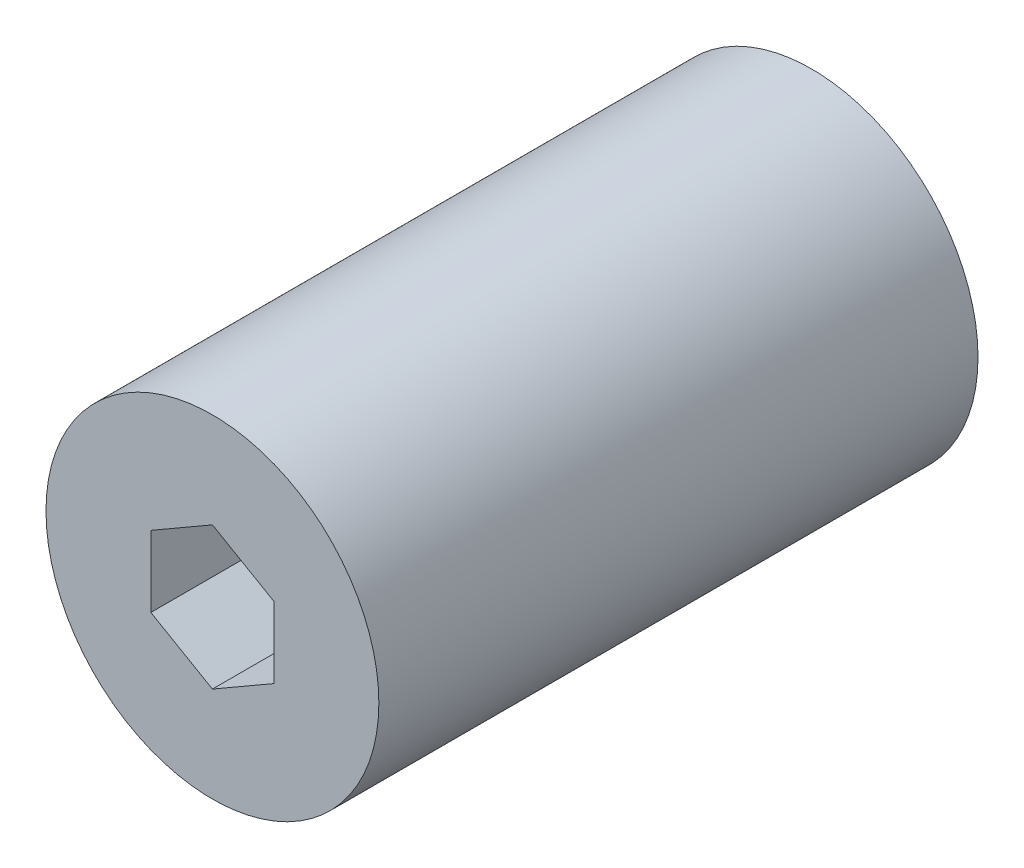
ISO-10303-21;
HEADER;
FILE_DESCRIPTION(('STEP AP214'),'2;1');
FILE_NAME('part.step','',(''),(''),'','','');
FILE_SCHEMA(('AUTOMOTIVE_DESIGN { 1 0 10303 214 1 1 1 1 }'));
ENDSEC;
DATA;
#1=APPLICATION_CONTEXT('core data for automotive mechanical design processes');
#2=APPLICATION_PROTOCOL_DEFINITION('international standard','automotive_design',2000,#1);
#3=PRODUCT_CONTEXT('',#1,'mechanical');
#4=PRODUCT('Part','Part','',(#3));
#5=PRODUCT_RELATED_PRODUCT_CATEGORY('part','',(#4));
#6=PRODUCT_DEFINITION_FORMATION('','',#4);
#7=PRODUCT_DEFINITION_CONTEXT('part definition',#1,'design');
#8=PRODUCT_DEFINITION('design','',#6,#7);
#9=PRODUCT_DEFINITION_SHAPE('','',#8);
#10=(LENGTH_UNIT() NAMED_UNIT(*) SI_UNIT(.MILLI.,.METRE.));
#11=(NAMED_UNIT(*) PLANE_ANGLE_UNIT() SI_UNIT($,.RADIAN.));
#12=(NAMED_UNIT(*) SI_UNIT($,.STERADIAN.) SOLID_ANGLE_UNIT());
#13=UNCERTAINTY_MEASURE_WITH_UNIT(LENGTH_MEASURE(1.E-05),#10,'distance_accuracy_value','');
#14=(GEOMETRIC_REPRESENTATION_CONTEXT(3) GLOBAL_UNCERTAINTY_ASSIGNED_CONTEXT((#13)) GLOBAL_UNIT_ASSIGNED_CONTEXT((#10,
#11,#12)) REPRESENTATION_CONTEXT('',''));
#15=CARTESIAN_POINT('',(0.,0.,0.));
#16=DIRECTION('',(0.,0.,1.));
#17=DIRECTION('',(1.,0.,0.));
#18=AXIS2_PLACEMENT_3D('',#15,#16,#17);
#19=CARTESIAN_POINT('',(0.,0.,-0.001000000000001));
#20=DIRECTION('',(0.,0.,1.));
#21=DIRECTION('',(1.,0.,0.));
#22=AXIS2_PLACEMENT_3D('',#19,#20,#21);
#23=CYLINDRICAL_SURFACE('',#22,1.6);
#24=CARTESIAN_POINT('',(0.,0.,0.));
#25=DIRECTION('',(0.,0.,1.));
#26=DIRECTION('',(1.,0.,0.));
#27=AXIS2_PLACEMENT_3D('',#24,#25,#26);
#28=CIRCLE('',#27,1.6);
#29=CARTESIAN_POINT('',(1.6,0.,0.));
#30=VERTEX_POINT('',#29);
#31=EDGE_CURVE('E143',#30,#30,#28,.F.);
#32=ORIENTED_EDGE('',*,*,#31,.T.);
#33=EDGE_LOOP('',(#32));
#34=FACE_BOUND('',#33,.T.);
#35=CARTESIAN_POINT('',(0.,0.,21.));
#36=DIRECTION('',(0.,0.,1.));
#37=DIRECTION('',(1.,0.,0.));
#38=AXIS2_PLACEMENT_3D('',#35,#36,#37);
#39=CIRCLE('',#38,1.6);
#40=CARTESIAN_POINT('',(1.6,0.,21.));
#41=VERTEX_POINT('',#40);
#42=EDGE_CURVE('E37',#41,#41,#39,.F.);
#43=ORIENTED_EDGE('',*,*,#42,.F.);
#44=EDGE_LOOP('',(#43));
#45=FACE_BOUND('',#44,.T.);
#46=ADVANCED_FACE('F33',(#34,#45),#23,.F.);
#47=CARTESIAN_POINT('',(0.,0.,36.));
#48=DIRECTION('',(0.,0.,-1.));
#49=DIRECTION('',(-1.,0.,0.));
#50=AXIS2_PLACEMENT_3D('',#47,#48,#49);
#51=CYLINDRICAL_SURFACE('',#50,10.);
#52=CARTESIAN_POINT('',(0.,0.,36.));
#53=DIRECTION('',(0.,0.,1.));
#54=DIRECTION('',(1.,0.,0.));
#55=AXIS2_PLACEMENT_3D('',#52,#53,#54);
#56=CIRCLE('',#55,10.);
#57=CARTESIAN_POINT('',(10.,0.,36.));
#58=VERTEX_POINT('',#57);
#59=EDGE_CURVE('E11',#58,#58,#56,.T.);
#60=ORIENTED_EDGE('',*,*,#59,.F.);
#61=EDGE_LOOP('',(#60));
#62=FACE_BOUND('',#61,.T.);
#63=CARTESIAN_POINT('',(0.,0.,0.));
#64=DIRECTION('',(0.,0.,1.));
#65=DIRECTION('',(1.,0.,0.));
#66=AXIS2_PLACEMENT_3D('',#63,#64,#65);
#67=CIRCLE('',#66,10.);
#68=CARTESIAN_POINT('',(10.,0.,0.));
#69=VERTEX_POINT('',#68);
#70=EDGE_CURVE('E42',#69,#69,#67,.T.);
#71=ORIENTED_EDGE('',*,*,#70,.T.);
#72=EDGE_LOOP('',(#71));
#73=FACE_BOUND('',#72,.T.);
#74=ADVANCED_FACE('F35',(#62,#73),#51,.T.);
#75=CARTESIAN_POINT('',(0.,0.,36.));
#76=DIRECTION('',(0.,0.,1.));
#77=DIRECTION('',(1.,0.,0.));
#78=AXIS2_PLACEMENT_3D('',#75,#76,#77);
#79=PLANE('',#78);
#80=DIRECTION('',(-0.866025403784439,0.5,0.));
#81=VECTOR('',#80,1.);
#82=CARTESIAN_POINT('',(3.7,2.13619599600162,36.));
#83=LINE('',#82,#81);
#84=CARTESIAN_POINT('',(3.7,2.13619599600162,36.));
#85=VERTEX_POINT('',#84);
#86=CARTESIAN_POINT('',(0.,4.27239199200323,36.));
#87=VERTEX_POINT('',#86);
#88=EDGE_CURVE('E50',#85,#87,#83,.T.);
#89=ORIENTED_EDGE('',*,*,#88,.F.);
#90=DIRECTION('',(0.,1.,0.));
#91=VECTOR('',#90,1.);
#92=CARTESIAN_POINT('',(3.7,-2.13619599600162,36.));
#93=LINE('',#92,#91);
#94=CARTESIAN_POINT('',(3.7,-2.13619599600162,36.));
#95=VERTEX_POINT('',#94);
#96=EDGE_CURVE('E134',#95,#85,#93,.T.);
#97=ORIENTED_EDGE('',*,*,#96,.F.);
#98=DIRECTION('',(0.866025403784439,0.5,0.));
#99=VECTOR('',#98,1.);
#100=CARTESIAN_POINT('',(0.,-4.27239199200323,36.));
#101=LINE('',#100,#99);
#102=CARTESIAN_POINT('',(0.,-4.27239199200323,36.));
#103=VERTEX_POINT('',#102);
#104=EDGE_CURVE('E132',#103,#95,#101,.T.);
#105=ORIENTED_EDGE('',*,*,#104,.F.);
#106=DIRECTION('',(0.866025403784439,-0.5,0.));
#107=VECTOR('',#106,1.);
#108=CARTESIAN_POINT('',(-3.7,-2.13619599600162,36.));
#109=LINE('',#108,#107);
#110=CARTESIAN_POINT('',(-3.7,-2.13619599600162,36.));
#111=VERTEX_POINT('',#110);
#112=EDGE_CURVE('E98',#111,#103,#109,.T.);
#113=ORIENTED_EDGE('',*,*,#112,.F.);
#114=DIRECTION('',(0.,-1.,0.));
#115=VECTOR('',#114,1.);
#116=CARTESIAN_POINT('',(-3.7,2.13619599600162,36.));
#117=LINE('',#116,#115);
#118=CARTESIAN_POINT('',(-3.7,2.13619599600162,36.));
#119=VERTEX_POINT('',#118);
#120=EDGE_CURVE('E128',#119,#111,#117,.T.);
#121=ORIENTED_EDGE('',*,*,#120,.F.);
#122=DIRECTION('',(-0.866025403784439,-0.5,0.));
#123=VECTOR('',#122,1.);
#124=CARTESIAN_POINT('',(0.,4.27239199200323,36.));
#125=LINE('',#124,#123);
#126=EDGE_CURVE('E125',#87,#119,#125,.T.);
#127=ORIENTED_EDGE('',*,*,#126,.F.);
#128=EDGE_LOOP('',(#89,#97,#105,#113,#121,#127));
#129=FACE_BOUND('',#128,.T.);
#130=ORIENTED_EDGE('',*,*,#59,.T.);
#131=EDGE_LOOP('',(#130));
#132=FACE_BOUND('',#131,.T.);
#133=ADVANCED_FACE('F151',(#129,#132),#79,.T.);
#134=CARTESIAN_POINT('',(0.,0.,0.));
#135=DIRECTION('',(0.,0.,1.));
#136=DIRECTION('',(1.,0.,0.));
#137=AXIS2_PLACEMENT_3D('',#134,#135,#136);
#138=PLANE('',#137);
#139=ORIENTED_EDGE('',*,*,#31,.F.);
#140=EDGE_LOOP('',(#139));
#141=FACE_BOUND('',#140,.T.);
#142=ORIENTED_EDGE('',*,*,#70,.F.);
#143=EDGE_LOOP('',(#142));
#144=FACE_BOUND('',#143,.T.);
#145=ADVANCED_FACE('F149',(#141,#144),#138,.F.);
#146=CARTESIAN_POINT('',(0.,0.,21.));
#147=DIRECTION('',(0.,0.,1.));
#148=DIRECTION('',(1.,0.,0.));
#149=AXIS2_PLACEMENT_3D('',#146,#147,#148);
#150=PLANE('',#149);
#151=DIRECTION('',(-0.866025403784439,0.5,0.));
#152=VECTOR('',#151,1.);
#153=CARTESIAN_POINT('',(3.7,2.13619599600162,21.));
#154=LINE('',#153,#152);
#155=CARTESIAN_POINT('',(3.7,2.13619599600162,21.));
#156=VERTEX_POINT('',#155);
#157=CARTESIAN_POINT('',(0.,4.27239199200323,21.));
#158=VERTEX_POINT('',#157);
#159=EDGE_CURVE('E136',#156,#158,#154,.T.);
#160=ORIENTED_EDGE('',*,*,#159,.T.);
#161=DIRECTION('',(-0.866025403784439,-0.5,0.));
#162=VECTOR('',#161,1.);
#163=CARTESIAN_POINT('',(0.,4.27239199200323,21.));
#164=LINE('',#163,#162);
#165=CARTESIAN_POINT('',(-3.7,2.13619599600162,21.));
#166=VERTEX_POINT('',#165);
#167=EDGE_CURVE('E119',#158,#166,#164,.T.);
#168=ORIENTED_EDGE('',*,*,#167,.T.);
#169=DIRECTION('',(0.,-1.,0.));
#170=VECTOR('',#169,1.);
#171=CARTESIAN_POINT('',(-3.7,2.13619599600162,21.));
#172=LINE('',#171,#170);
#173=CARTESIAN_POINT('',(-3.7,-2.13619599600162,21.));
#174=VERTEX_POINT('',#173);
#175=EDGE_CURVE('E117',#166,#174,#172,.T.);
#176=ORIENTED_EDGE('',*,*,#175,.T.);
#177=DIRECTION('',(0.866025403784439,-0.5,0.));
#178=VECTOR('',#177,1.);
#179=CARTESIAN_POINT('',(-3.7,-2.13619599600162,21.));
#180=LINE('',#179,#178);
#181=CARTESIAN_POINT('',(0.,-4.27239199200323,21.));
#182=VERTEX_POINT('',#181);
#183=EDGE_CURVE('E95',#174,#182,#180,.T.);
#184=ORIENTED_EDGE('',*,*,#183,.T.);
#185=DIRECTION('',(0.866025403784439,0.5,0.));
#186=VECTOR('',#185,1.);
#187=CARTESIAN_POINT('',(0.,-4.27239199200323,21.));
#188=LINE('',#187,#186);
#189=CARTESIAN_POINT('',(3.7,-2.13619599600162,21.));
#190=VERTEX_POINT('',#189);
#191=EDGE_CURVE('E106',#182,#190,#188,.T.);
#192=ORIENTED_EDGE('',*,*,#191,.T.);
#193=DIRECTION('',(0.,1.,0.));
#194=VECTOR('',#193,1.);
#195=CARTESIAN_POINT('',(3.7,-2.13619599600162,21.));
#196=LINE('',#195,#194);
#197=EDGE_CURVE('E110',#190,#156,#196,.T.);
#198=ORIENTED_EDGE('',*,*,#197,.T.);
#199=EDGE_LOOP('',(#160,#168,#176,#184,#192,#198));
#200=FACE_BOUND('',#199,.T.);
#201=ORIENTED_EDGE('',*,*,#42,.T.);
#202=EDGE_LOOP('',(#201));
#203=FACE_BOUND('',#202,.T.);
#204=ADVANCED_FACE('F113',(#200,#203),#150,.T.);
#205=CARTESIAN_POINT('',(3.7,2.13619599600162,21.));
#206=DIRECTION('',(0.499999999999999,0.866025403784439,0.));
#207=DIRECTION('',(-0.866025403784439,0.5,0.));
#208=AXIS2_PLACEMENT_3D('',#205,#206,#207);
#209=PLANE('',#208);
#210=ORIENTED_EDGE('',*,*,#88,.T.);
#211=DIRECTION('',(0.,0.,1.));
#212=VECTOR('',#211,1.);
#213=CARTESIAN_POINT('',(0.,4.27239199200323,21.));
#214=LINE('',#213,#212);
#215=EDGE_CURVE('E80',#158,#87,#214,.T.);
#216=ORIENTED_EDGE('',*,*,#215,.F.);
#217=ORIENTED_EDGE('',*,*,#159,.F.);
#218=DIRECTION('',(0.,0.,1.));
#219=VECTOR('',#218,1.);
#220=CARTESIAN_POINT('',(3.7,2.13619599600162,21.));
#221=LINE('',#220,#219);
#222=EDGE_CURVE('E58',#156,#85,#221,.T.);
#223=ORIENTED_EDGE('',*,*,#222,.T.);
#224=EDGE_LOOP('',(#210,#216,#217,#223));
#225=FACE_BOUND('',#224,.T.);
#226=ADVANCED_FACE('F157',(#225),#209,.F.);
#227=CARTESIAN_POINT('',(3.7,-2.13619599600162,21.));
#228=DIRECTION('',(1.,0.,0.));
#229=DIRECTION('',(0.,1.,0.));
#230=AXIS2_PLACEMENT_3D('',#227,#228,#229);
#231=PLANE('',#230);
#232=ORIENTED_EDGE('',*,*,#96,.T.);
#233=ORIENTED_EDGE('',*,*,#222,.F.);
#234=ORIENTED_EDGE('',*,*,#197,.F.);
#235=DIRECTION('',(0.,0.,1.));
#236=VECTOR('',#235,1.);
#237=CARTESIAN_POINT('',(3.7,-2.13619599600162,21.));
#238=LINE('',#237,#236);
#239=EDGE_CURVE('E102',#190,#95,#238,.T.);
#240=ORIENTED_EDGE('',*,*,#239,.T.);
#241=EDGE_LOOP('',(#232,#233,#234,#240));
#242=FACE_BOUND('',#241,.T.);
#243=ADVANCED_FACE('F173',(#242),#231,.F.);
#244=CARTESIAN_POINT('',(0.,-4.27239199200323,21.));
#245=DIRECTION('',(0.5,-0.866025403784439,0.));
#246=DIRECTION('',(0.866025403784439,0.5,0.));
#247=AXIS2_PLACEMENT_3D('',#244,#245,#246);
#248=PLANE('',#247);
#249=ORIENTED_EDGE('',*,*,#104,.T.);
#250=ORIENTED_EDGE('',*,*,#239,.F.);
#251=ORIENTED_EDGE('',*,*,#191,.F.);
#252=DIRECTION('',(0.,0.,1.));
#253=VECTOR('',#252,1.);
#254=CARTESIAN_POINT('',(0.,-4.27239199200323,21.));
#255=LINE('',#254,#253);
#256=EDGE_CURVE('E91',#182,#103,#255,.T.);
#257=ORIENTED_EDGE('',*,*,#256,.T.);
#258=EDGE_LOOP('',(#249,#250,#251,#257));
#259=FACE_BOUND('',#258,.T.);
#260=ADVANCED_FACE('F107',(#259),#248,.F.);
#261=CARTESIAN_POINT('',(-3.7,-2.13619599600162,21.));
#262=DIRECTION('',(-0.5,-0.866025403784439,0.));
#263=DIRECTION('',(0.866025403784439,-0.5,0.));
#264=AXIS2_PLACEMENT_3D('',#261,#262,#263);
#265=PLANE('',#264);
#266=ORIENTED_EDGE('',*,*,#112,.T.);
#267=ORIENTED_EDGE('',*,*,#256,.F.);
#268=ORIENTED_EDGE('',*,*,#183,.F.);
#269=DIRECTION('',(0.,0.,1.));
#270=VECTOR('',#269,1.);
#271=CARTESIAN_POINT('',(-3.7,-2.13619599600162,21.));
#272=LINE('',#271,#270);
#273=EDGE_CURVE('E103',#174,#111,#272,.T.);
#274=ORIENTED_EDGE('',*,*,#273,.T.);
#275=EDGE_LOOP('',(#266,#267,#268,#274));
#276=FACE_BOUND('',#275,.T.);
#277=ADVANCED_FACE('F93',(#276),#265,.F.);
#278=CARTESIAN_POINT('',(-3.7,2.13619599600162,21.));
#279=DIRECTION('',(-1.,0.,0.));
#280=DIRECTION('',(0.,-1.,0.));
#281=AXIS2_PLACEMENT_3D('',#278,#279,#280);
#282=PLANE('',#281);
#283=ORIENTED_EDGE('',*,*,#120,.T.);
#284=ORIENTED_EDGE('',*,*,#273,.F.);
#285=ORIENTED_EDGE('',*,*,#175,.F.);
#286=DIRECTION('',(0.,0.,1.));
#287=VECTOR('',#286,1.);
#288=CARTESIAN_POINT('',(-3.7,2.13619599600162,21.));
#289=LINE('',#288,#287);
#290=EDGE_CURVE('E140',#166,#119,#289,.T.);
#291=ORIENTED_EDGE('',*,*,#290,.T.);
#292=EDGE_LOOP('',(#283,#284,#285,#291));
#293=FACE_BOUND('',#292,.T.);
#294=ADVANCED_FACE('F177',(#293),#282,.F.);
#295=CARTESIAN_POINT('',(0.,4.27239199200323,21.));
#296=DIRECTION('',(-0.5,0.866025403784439,0.));
#297=DIRECTION('',(-0.866025403784439,-0.5,0.));
#298=AXIS2_PLACEMENT_3D('',#295,#296,#297);
#299=PLANE('',#298);
#300=ORIENTED_EDGE('',*,*,#126,.T.);
#301=ORIENTED_EDGE('',*,*,#290,.F.);
#302=ORIENTED_EDGE('',*,*,#167,.F.);
#303=ORIENTED_EDGE('',*,*,#215,.T.);
#304=EDGE_LOOP('',(#300,#301,#302,#303));
#305=FACE_BOUND('',#304,.T.);
#306=ADVANCED_FACE('F174',(#305),#299,.F.);
#307=CLOSED_SHELL('',(#46,#74,#133,#145,#204,#226,#243,#260,#277,#294,#306));
#308=MANIFOLD_SOLID_BREP('B2',#307);
#309=ADVANCED_BREP_SHAPE_REPRESENTATION('',(#18,#308),#14);
#310=SHAPE_DEFINITION_REPRESENTATION(#9,#309);
ENDSEC;
END-ISO-10303-21;
